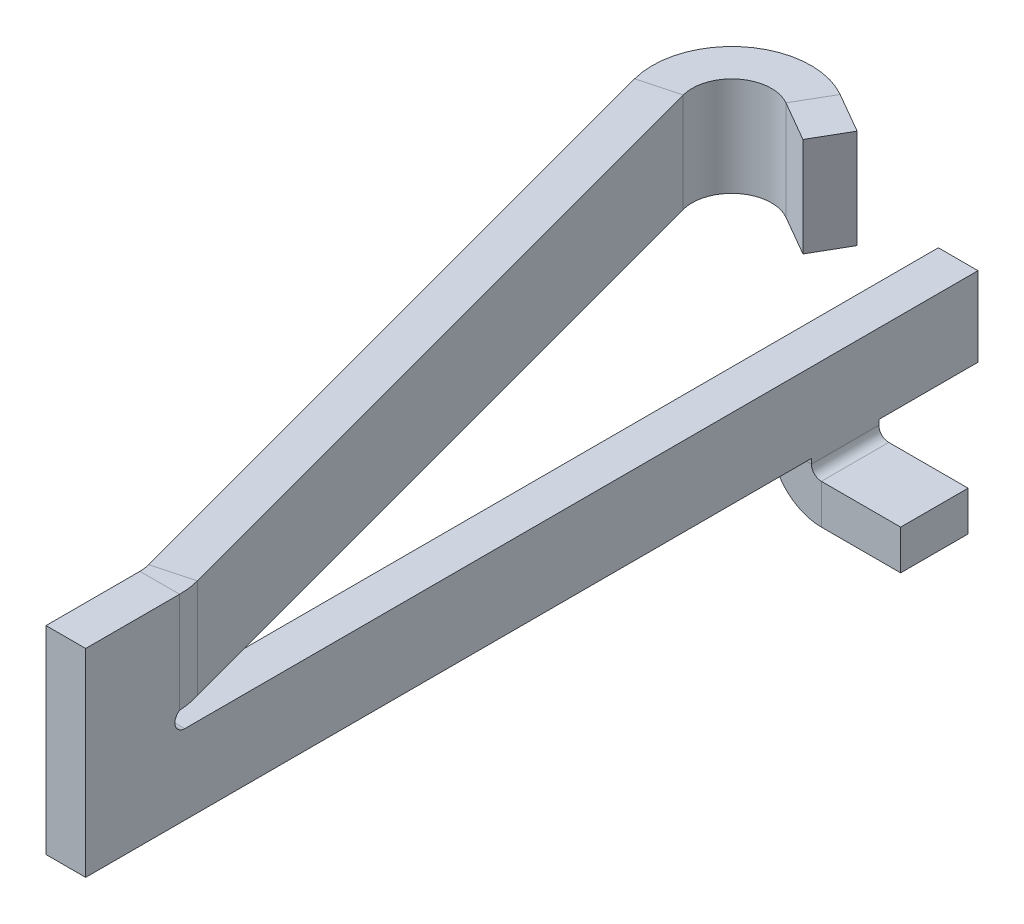
ISO-10303-21;
HEADER;
FILE_DESCRIPTION(('STEP AP214'),'2;1');
FILE_NAME('part.step','',(''),(''),'','','');
FILE_SCHEMA(('AUTOMOTIVE_DESIGN { 1 0 10303 214 1 1 1 1 }'));
ENDSEC;
DATA;
#1=APPLICATION_CONTEXT('core data for automotive mechanical design processes');
#2=APPLICATION_PROTOCOL_DEFINITION('international standard','automotive_design',2000,#1);
#3=PRODUCT_CONTEXT('',#1,'mechanical');
#4=PRODUCT('Part','Part','',(#3));
#5=PRODUCT_RELATED_PRODUCT_CATEGORY('part','',(#4));
#6=PRODUCT_DEFINITION_FORMATION('','',#4);
#7=PRODUCT_DEFINITION_CONTEXT('part definition',#1,'design');
#8=PRODUCT_DEFINITION('design','',#6,#7);
#9=PRODUCT_DEFINITION_SHAPE('','',#8);
#10=(LENGTH_UNIT() NAMED_UNIT(*) SI_UNIT(.MILLI.,.METRE.));
#11=(NAMED_UNIT(*) PLANE_ANGLE_UNIT() SI_UNIT($,.RADIAN.));
#12=(NAMED_UNIT(*) SI_UNIT($,.STERADIAN.) SOLID_ANGLE_UNIT());
#13=UNCERTAINTY_MEASURE_WITH_UNIT(LENGTH_MEASURE(1.E-05),#10,'distance_accuracy_value','');
#14=(GEOMETRIC_REPRESENTATION_CONTEXT(3) GLOBAL_UNCERTAINTY_ASSIGNED_CONTEXT((#13)) GLOBAL_UNIT_ASSIGNED_CONTEXT((#10,
#11,#12)) REPRESENTATION_CONTEXT('',''));
#15=CARTESIAN_POINT('',(0.,0.,0.));
#16=DIRECTION('',(0.,0.,1.));
#17=DIRECTION('',(1.,0.,0.));
#18=AXIS2_PLACEMENT_3D('',#15,#16,#17);
#19=CARTESIAN_POINT('',(4.6,0.662500000000014,-2.65));
#20=DIRECTION('',(1.,0.,0.));
#21=DIRECTION('',(0.,0.,1.));
#22=AXIS2_PLACEMENT_3D('',#19,#20,#21);
#23=PLANE('',#22);
#24=DIRECTION('',(0.,0.,-1.));
#25=VECTOR('',#24,1.);
#26=CARTESIAN_POINT('',(4.6,0.175000000000024,-3.355));
#27=LINE('',#26,#25);
#28=CARTESIAN_POINT('',(4.6,0.175000000000027,-4.06));
#29=VERTEX_POINT('',#28);
#30=CARTESIAN_POINT('',(4.6,0.175000000000028,-4.4));
#31=VERTEX_POINT('',#30);
#32=EDGE_CURVE('E299',#29,#31,#27,.T.);
#33=ORIENTED_EDGE('',*,*,#32,.T.);
#34=DIRECTION('',(0.,1.,0.));
#35=VECTOR('',#34,1.);
#36=CARTESIAN_POINT('',(4.6,0.200000000000026,-4.4));
#37=LINE('',#36,#35);
#38=CARTESIAN_POINT('',(4.6,0.200000000000026,-4.4));
#39=VERTEX_POINT('',#38);
#40=EDGE_CURVE('E367',#31,#39,#37,.T.);
#41=ORIENTED_EDGE('',*,*,#40,.T.);
#42=DIRECTION('',(0.,0.,-1.));
#43=VECTOR('',#42,1.);
#44=CARTESIAN_POINT('',(4.6,0.200000000000028,-4.9));
#45=LINE('',#44,#43);
#46=CARTESIAN_POINT('',(4.6,0.200000000000028,-4.9));
#47=VERTEX_POINT('',#46);
#48=EDGE_CURVE('E11',#39,#47,#45,.T.);
#49=ORIENTED_EDGE('',*,*,#48,.T.);
#50=DIRECTION('',(0.,1.,0.));
#51=VECTOR('',#50,1.);
#52=CARTESIAN_POINT('',(4.6,0.600000000000123,-4.9));
#53=LINE('',#52,#51);
#54=CARTESIAN_POINT('',(4.6,0.600000000000123,-4.9));
#55=VERTEX_POINT('',#54);
#56=EDGE_CURVE('E295',#47,#55,#53,.T.);
#57=ORIENTED_EDGE('',*,*,#56,.T.);
#58=DIRECTION('',(0.,0.,1.));
#59=VECTOR('',#58,1.);
#60=CARTESIAN_POINT('',(4.6,0.6,-0.9));
#61=LINE('',#60,#59);
#62=CARTESIAN_POINT('',(4.6,0.6,-0.9));
#63=VERTEX_POINT('',#62);
#64=EDGE_CURVE('E391',#55,#63,#61,.T.);
#65=ORIENTED_EDGE('',*,*,#64,.T.);
#66=CARTESIAN_POINT('',(4.6,0.65,-0.9));
#67=DIRECTION('',(-1.,0.,0.));
#68=DIRECTION('',(0.,1.,0.));
#69=AXIS2_PLACEMENT_3D('',#66,#67,#68);
#70=CIRCLE('',#69,0.05);
#71=CARTESIAN_POINT('',(4.6,0.692505350194535,-0.873669500482522));
#72=VERTEX_POINT('',#71);
#73=EDGE_CURVE('E293',#63,#72,#70,.T.);
#74=ORIENTED_EDGE('',*,*,#73,.T.);
#75=DIRECTION('',(0.,1.,0.));
#76=VECTOR('',#75,1.);
#77=CARTESIAN_POINT('',(4.6,0.93125,-0.873669500482521));
#78=LINE('',#77,#76);
#79=CARTESIAN_POINT('',(4.6,1.2,-0.873669500482521));
#80=VERTEX_POINT('',#79);
#81=EDGE_CURVE('E372',#72,#80,#78,.T.);
#82=ORIENTED_EDGE('',*,*,#81,.T.);
#83=DIRECTION('',(0.,0.,1.));
#84=VECTOR('',#83,1.);
#85=CARTESIAN_POINT('',(4.6,1.2,-0.4));
#86=LINE('',#85,#84);
#87=CARTESIAN_POINT('',(4.6,1.2,-0.4));
#88=VERTEX_POINT('',#87);
#89=EDGE_CURVE('E218',#80,#88,#86,.T.);
#90=ORIENTED_EDGE('',*,*,#89,.T.);
#91=DIRECTION('',(0.,-1.,0.));
#92=VECTOR('',#91,1.);
#93=CARTESIAN_POINT('',(4.6,0.199999999999844,-0.4));
#94=LINE('',#93,#92);
#95=CARTESIAN_POINT('',(4.6,0.199999999999844,-0.4));
#96=VERTEX_POINT('',#95);
#97=EDGE_CURVE('E378',#88,#96,#94,.T.);
#98=ORIENTED_EDGE('',*,*,#97,.T.);
#99=DIRECTION('',(0.,0.,-1.));
#100=VECTOR('',#99,1.);
#101=CARTESIAN_POINT('',(4.6,0.2,-4.06));
#102=LINE('',#101,#100);
#103=CARTESIAN_POINT('',(4.6,0.2,-4.06));
#104=VERTEX_POINT('',#103);
#105=EDGE_CURVE('E398',#96,#104,#102,.T.);
#106=ORIENTED_EDGE('',*,*,#105,.T.);
#107=DIRECTION('',(0.,-1.,0.));
#108=VECTOR('',#107,1.);
#109=CARTESIAN_POINT('',(4.6,0.125000000000027,-4.06));
#110=LINE('',#109,#108);
#111=EDGE_CURVE('E323',#104,#29,#110,.T.);
#112=ORIENTED_EDGE('',*,*,#111,.T.);
#113=EDGE_LOOP('',(#33,#41,#49,#57,#65,#74,#82,#90,#98,#106,#112));
#114=FACE_BOUND('',#113,.T.);
#115=ADVANCED_FACE('F16',(#114),#23,.T.);
#116=CARTESIAN_POINT('',(4.4,0.200000000000026,-4.4));
#117=DIRECTION('',(0.,-1.,0.));
#118=DIRECTION('',(0.,0.,-1.));
#119=AXIS2_PLACEMENT_3D('',#116,#117,#118);
#120=PLANE('',#119);
#121=DIRECTION('',(0.,0.,1.));
#122=VECTOR('',#121,1.);
#123=CARTESIAN_POINT('',(4.4,0.200000000000028,-4.9));
#124=LINE('',#123,#122);
#125=CARTESIAN_POINT('',(4.4,0.200000000000028,-4.9));
#126=VERTEX_POINT('',#125);
#127=CARTESIAN_POINT('',(4.4,0.200000000000026,-4.4));
#128=VERTEX_POINT('',#127);
#129=EDGE_CURVE('E290',#126,#128,#124,.T.);
#130=ORIENTED_EDGE('',*,*,#129,.F.);
#131=DIRECTION('',(1.,0.,0.));
#132=VECTOR('',#131,1.);
#133=CARTESIAN_POINT('',(4.4,0.200000000000028,-4.9));
#134=LINE('',#133,#132);
#135=EDGE_CURVE('E27',#126,#47,#134,.T.);
#136=ORIENTED_EDGE('',*,*,#135,.T.);
#137=ORIENTED_EDGE('',*,*,#48,.F.);
#138=DIRECTION('',(1.,0.,0.));
#139=VECTOR('',#138,1.);
#140=CARTESIAN_POINT('',(4.4,0.200000000000026,-4.4));
#141=LINE('',#140,#139);
#142=EDGE_CURVE('E335',#128,#39,#141,.T.);
#143=ORIENTED_EDGE('',*,*,#142,.F.);
#144=EDGE_LOOP('',(#130,#136,#137,#143));
#145=FACE_BOUND('',#144,.T.);
#146=ADVANCED_FACE('F780',(#145),#120,.T.);
#147=CARTESIAN_POINT('',(4.4,0.200000000000028,-4.9));
#148=DIRECTION('',(0.,0.,-1.));
#149=DIRECTION('',(-1.,0.,0.));
#150=AXIS2_PLACEMENT_3D('',#147,#148,#149);
#151=PLANE('',#150);
#152=DIRECTION('',(0.,-1.,0.));
#153=VECTOR('',#152,1.);
#154=CARTESIAN_POINT('',(4.4,0.600000000000123,-4.9));
#155=LINE('',#154,#153);
#156=CARTESIAN_POINT('',(4.4,0.600000000000123,-4.9));
#157=VERTEX_POINT('',#156);
#158=EDGE_CURVE('E294',#157,#126,#155,.T.);
#159=ORIENTED_EDGE('',*,*,#158,.F.);
#160=DIRECTION('',(1.,0.,0.));
#161=VECTOR('',#160,1.);
#162=CARTESIAN_POINT('',(4.4,0.600000000000123,-4.9));
#163=LINE('',#162,#161);
#164=EDGE_CURVE('E298',#157,#55,#163,.T.);
#165=ORIENTED_EDGE('',*,*,#164,.T.);
#166=ORIENTED_EDGE('',*,*,#56,.F.);
#167=ORIENTED_EDGE('',*,*,#135,.F.);
#168=EDGE_LOOP('',(#159,#165,#166,#167));
#169=FACE_BOUND('',#168,.T.);
#170=ADVANCED_FACE('F783',(#169),#151,.T.);
#171=CARTESIAN_POINT('',(4.4,0.600000000000123,-4.9));
#172=DIRECTION('',(0.,1.,0.));
#173=DIRECTION('',(0.,0.,-1.));
#174=AXIS2_PLACEMENT_3D('',#171,#172,#173);
#175=PLANE('',#174);
#176=DIRECTION('',(0.,0.,-1.));
#177=VECTOR('',#176,1.);
#178=CARTESIAN_POINT('',(4.4,0.6,-0.9));
#179=LINE('',#178,#177);
#180=CARTESIAN_POINT('',(4.4,0.6,-0.9));
#181=VERTEX_POINT('',#180);
#182=EDGE_CURVE('E508',#181,#157,#179,.T.);
#183=ORIENTED_EDGE('',*,*,#182,.F.);
#184=DIRECTION('',(1.,0.,0.));
#185=VECTOR('',#184,1.);
#186=CARTESIAN_POINT('',(4.4,0.6,-0.9));
#187=LINE('',#186,#185);
#188=EDGE_CURVE('E322',#181,#63,#187,.T.);
#189=ORIENTED_EDGE('',*,*,#188,.T.);
#190=ORIENTED_EDGE('',*,*,#64,.F.);
#191=ORIENTED_EDGE('',*,*,#164,.F.);
#192=EDGE_LOOP('',(#183,#189,#190,#191));
#193=FACE_BOUND('',#192,.T.);
#194=ADVANCED_FACE('F789',(#193),#175,.T.);
#195=CARTESIAN_POINT('',(4.4,1.2,-0.4));
#196=DIRECTION('',(0.,0.,1.));
#197=DIRECTION('',(1.,0.,0.));
#198=AXIS2_PLACEMENT_3D('',#195,#196,#197);
#199=PLANE('',#198);
#200=DIRECTION('',(0.,1.,0.));
#201=VECTOR('',#200,1.);
#202=CARTESIAN_POINT('',(4.4,0.199999999999844,-0.4));
#203=LINE('',#202,#201);
#204=CARTESIAN_POINT('',(4.4,0.199999999999844,-0.4));
#205=VERTEX_POINT('',#204);
#206=CARTESIAN_POINT('',(4.4,1.2,-0.4));
#207=VERTEX_POINT('',#206);
#208=EDGE_CURVE('E386',#205,#207,#203,.T.);
#209=ORIENTED_EDGE('',*,*,#208,.F.);
#210=DIRECTION('',(1.,0.,0.));
#211=VECTOR('',#210,1.);
#212=CARTESIAN_POINT('',(4.4,0.199999999999844,-0.4));
#213=LINE('',#212,#211);
#214=EDGE_CURVE('E388',#205,#96,#213,.T.);
#215=ORIENTED_EDGE('',*,*,#214,.T.);
#216=ORIENTED_EDGE('',*,*,#97,.F.);
#217=DIRECTION('',(1.,0.,0.));
#218=VECTOR('',#217,1.);
#219=CARTESIAN_POINT('',(4.4,1.2,-0.4));
#220=LINE('',#219,#218);
#221=EDGE_CURVE('E311',#207,#88,#220,.T.);
#222=ORIENTED_EDGE('',*,*,#221,.F.);
#223=EDGE_LOOP('',(#209,#215,#216,#222));
#224=FACE_BOUND('',#223,.T.);
#225=ADVANCED_FACE('F385',(#224),#199,.T.);
#226=CARTESIAN_POINT('',(4.4,0.199999999999844,-0.4));
#227=DIRECTION('',(0.,-1.,0.));
#228=DIRECTION('',(0.,0.,-1.));
#229=AXIS2_PLACEMENT_3D('',#226,#227,#228);
#230=PLANE('',#229);
#231=DIRECTION('',(0.,0.,1.));
#232=VECTOR('',#231,1.);
#233=CARTESIAN_POINT('',(4.4,0.2,-4.06));
#234=LINE('',#233,#232);
#235=CARTESIAN_POINT('',(4.4,0.2,-4.06));
#236=VERTEX_POINT('',#235);
#237=EDGE_CURVE('E283',#236,#205,#234,.T.);
#238=ORIENTED_EDGE('',*,*,#237,.F.);
#239=DIRECTION('',(1.,0.,0.));
#240=VECTOR('',#239,1.);
#241=CARTESIAN_POINT('',(4.4,0.2,-4.06));
#242=LINE('',#241,#240);
#243=EDGE_CURVE('E326',#236,#104,#242,.T.);
#244=ORIENTED_EDGE('',*,*,#243,.T.);
#245=ORIENTED_EDGE('',*,*,#105,.F.);
#246=ORIENTED_EDGE('',*,*,#214,.F.);
#247=EDGE_LOOP('',(#238,#244,#245,#246));
#248=FACE_BOUND('',#247,.T.);
#249=ADVANCED_FACE('F549',(#248),#230,.T.);
#250=CARTESIAN_POINT('',(4.4,0.2,-4.06));
#251=DIRECTION('',(0.,0.,1.));
#252=DIRECTION('',(1.,0.,0.));
#253=AXIS2_PLACEMENT_3D('',#250,#251,#252);
#254=PLANE('',#253);
#255=DIRECTION('',(1.,0.,0.));
#256=VECTOR('',#255,1.);
#257=CARTESIAN_POINT('',(4.5,0.175000000000027,-4.06));
#258=LINE('',#257,#256);
#259=CARTESIAN_POINT('',(4.4,0.175000000000027,-4.06));
#260=VERTEX_POINT('',#259);
#261=EDGE_CURVE('E314',#260,#29,#258,.T.);
#262=ORIENTED_EDGE('',*,*,#261,.T.);
#263=ORIENTED_EDGE('',*,*,#111,.F.);
#264=ORIENTED_EDGE('',*,*,#243,.F.);
#265=DIRECTION('',(0.,1.,0.));
#266=VECTOR('',#265,1.);
#267=CARTESIAN_POINT('',(4.4,0.125000000000027,-4.06));
#268=LINE('',#267,#266);
#269=EDGE_CURVE('E279',#260,#236,#268,.T.);
#270=ORIENTED_EDGE('',*,*,#269,.F.);
#271=EDGE_LOOP('',(#262,#263,#264,#270));
#272=FACE_BOUND('',#271,.T.);
#273=ADVANCED_FACE('F551',(#272),#254,.T.);
#274=CARTESIAN_POINT('',(4.4,0.65,-0.9));
#275=DIRECTION('',(1.,0.,0.));
#276=DIRECTION('',(0.,1.,0.));
#277=AXIS2_PLACEMENT_3D('',#274,#275,#276);
#278=CYLINDRICAL_SURFACE('',#277,0.05);
#279=DIRECTION('',(1.,0.,0.));
#280=VECTOR('',#279,1.);
#281=CARTESIAN_POINT('',(4.4,0.692505350194535,-0.873669500482522));
#282=LINE('',#281,#280);
#283=CARTESIAN_POINT('',(4.4,0.692505350194535,-0.873669500482522));
#284=VERTEX_POINT('',#283);
#285=EDGE_CURVE('E232',#284,#72,#282,.T.);
#286=ORIENTED_EDGE('',*,*,#285,.T.);
#287=ORIENTED_EDGE('',*,*,#73,.F.);
#288=ORIENTED_EDGE('',*,*,#188,.F.);
#289=CARTESIAN_POINT('',(4.4,0.65,-0.9));
#290=DIRECTION('',(1.,0.,0.));
#291=DIRECTION('',(0.,1.,0.));
#292=AXIS2_PLACEMENT_3D('',#289,#290,#291);
#293=CIRCLE('',#292,0.05);
#294=EDGE_CURVE('E168',#284,#181,#293,.T.);
#295=ORIENTED_EDGE('',*,*,#294,.F.);
#296=EDGE_LOOP('',(#286,#287,#288,#295));
#297=FACE_BOUND('',#296,.T.);
#298=ADVANCED_FACE('F790',(#297),#278,.F.);
#299=CARTESIAN_POINT('',(4.4,0.662500000000014,-2.65));
#300=DIRECTION('',(1.,0.,0.));
#301=DIRECTION('',(0.,0.,1.));
#302=AXIS2_PLACEMENT_3D('',#299,#300,#301);
#303=PLANE('',#302);
#304=DIRECTION('',(0.,0.,1.));
#305=VECTOR('',#304,1.);
#306=CARTESIAN_POINT('',(4.4,0.175000000000024,-3.355));
#307=LINE('',#306,#305);
#308=CARTESIAN_POINT('',(4.4,0.175000000000028,-4.4));
#309=VERTEX_POINT('',#308);
#310=EDGE_CURVE('E327',#309,#260,#307,.T.);
#311=ORIENTED_EDGE('',*,*,#310,.T.);
#312=ORIENTED_EDGE('',*,*,#269,.T.);
#313=ORIENTED_EDGE('',*,*,#237,.T.);
#314=ORIENTED_EDGE('',*,*,#208,.T.);
#315=DIRECTION('',(0.,0.,-1.));
#316=VECTOR('',#315,1.);
#317=CARTESIAN_POINT('',(4.4,1.2,-0.4));
#318=LINE('',#317,#316);
#319=CARTESIAN_POINT('',(4.4,1.2,-0.873669500482521));
#320=VERTEX_POINT('',#319);
#321=EDGE_CURVE('E157',#207,#320,#318,.T.);
#322=ORIENTED_EDGE('',*,*,#321,.T.);
#323=DIRECTION('',(0.,-1.,0.));
#324=VECTOR('',#323,1.);
#325=CARTESIAN_POINT('',(4.4,0.93125,-0.873669500482521));
#326=LINE('',#325,#324);
#327=EDGE_CURVE('E287',#320,#284,#326,.T.);
#328=ORIENTED_EDGE('',*,*,#327,.T.);
#329=ORIENTED_EDGE('',*,*,#294,.T.);
#330=ORIENTED_EDGE('',*,*,#182,.T.);
#331=ORIENTED_EDGE('',*,*,#158,.T.);
#332=ORIENTED_EDGE('',*,*,#129,.T.);
#333=DIRECTION('',(0.,-1.,0.));
#334=VECTOR('',#333,1.);
#335=CARTESIAN_POINT('',(4.4,0.200000000000026,-4.4));
#336=LINE('',#335,#334);
#337=EDGE_CURVE('E303',#128,#309,#336,.T.);
#338=ORIENTED_EDGE('',*,*,#337,.T.);
#339=EDGE_LOOP('',(#311,#312,#313,#314,#322,#328,#329,#330,#331,#332,#338));
#340=FACE_BOUND('',#339,.T.);
#341=ADVANCED_FACE('F778',(#340),#303,.F.);
#342=CARTESIAN_POINT('',(4.4,1.2,-0.9));
#343=DIRECTION('',(0.,1.,0.));
#344=DIRECTION('',(1.,0.,0.));
#345=AXIS2_PLACEMENT_3D('',#342,#343,#344);
#346=PLANE('',#345);
#347=DIRECTION('',(-1.,0.,0.));
#348=VECTOR('',#347,1.);
#349=CARTESIAN_POINT('',(4.4,1.2,-0.873669500482521));
#350=LINE('',#349,#348);
#351=EDGE_CURVE('E248',#80,#320,#350,.T.);
#352=ORIENTED_EDGE('',*,*,#351,.T.);
#353=ORIENTED_EDGE('',*,*,#321,.F.);
#354=ORIENTED_EDGE('',*,*,#221,.T.);
#355=ORIENTED_EDGE('',*,*,#89,.F.);
#356=EDGE_LOOP('',(#352,#353,#354,#355));
#357=FACE_BOUND('',#356,.T.);
#358=ADVANCED_FACE('F382',(#357),#346,.T.);
#359=CARTESIAN_POINT('',(4.2,0.946252675097268,-0.873669500482522));
#360=DIRECTION('',(0.,1.,0.));
#361=DIRECTION('',(1.,0.,0.));
#362=AXIS2_PLACEMENT_3D('',#359,#360,#361);
#363=CYLINDRICAL_SURFACE('',#362,0.2);
#364=DIRECTION('',(0.,1.,0.));
#365=VECTOR('',#364,1.);
#366=CARTESIAN_POINT('',(4.39318516525782,0.948001253419913,-0.925433309503026));
#367=LINE('',#366,#365);
#368=CARTESIAN_POINT('',(4.39318516525781,0.7,-0.925433309503025));
#369=VERTEX_POINT('',#368);
#370=CARTESIAN_POINT('',(4.39318516525781,1.2,-0.925433309503025));
#371=VERTEX_POINT('',#370);
#372=EDGE_CURVE('E251',#369,#371,#367,.T.);
#373=ORIENTED_EDGE('',*,*,#372,.F.);
#374=CARTESIAN_POINT('',(4.4,0.692505350194535,-0.873669500482522));
#375=CARTESIAN_POINT('',(4.4,0.695003566796357,-0.891122793002465));
#376=CARTESIAN_POINT('',(4.39770240976172,0.697501783398179,-0.908574723504235));
#377=CARTESIAN_POINT('',(4.39318516525781,0.7,-0.925433309503025));
#378=(BOUNDED_CURVE() B_SPLINE_CURVE(3,(#374,#375,#376,#377),.UNSPECIFIED.,.F.,
.F.) B_SPLINE_CURVE_WITH_KNOTS((4,4),(0.,0.261799387799145),
.UNSPECIFIED.) CURVE() GEOMETRIC_REPRESENTATION_ITEM() RATIONAL_B_SPLINE_CURVE((1.,1.,1.,1.)) REPRESENTATION_ITEM(''));
#379=EDGE_CURVE('E226',#284,#369,#378,.T.);
#380=ORIENTED_EDGE('',*,*,#379,.F.);
#381=ORIENTED_EDGE('',*,*,#327,.F.);
#382=CARTESIAN_POINT('',(4.2,1.2,-0.873669500482522));
#383=DIRECTION('',(0.,-1.,0.));
#384=DIRECTION('',(0.965925826289069,0.,-0.258819045102517));
#385=AXIS2_PLACEMENT_3D('',#382,#383,#384);
#386=CIRCLE('',#385,0.2);
#387=EDGE_CURVE('E254',#371,#320,#386,.T.);
#388=ORIENTED_EDGE('',*,*,#387,.F.);
#389=EDGE_LOOP('',(#373,#380,#381,#388));
#390=FACE_BOUND('',#389,.T.);
#391=ADVANCED_FACE('F252',(#390),#363,.F.);
#392=CARTESIAN_POINT('',(4.4,0.692505350194535,-0.873669500482521));
#393=CARTESIAN_POINT('',(4.46666666666667,0.692505350194535,-0.873669500482521));
#394=CARTESIAN_POINT('',(4.53333333333333,0.692505350194535,-0.873669500482521));
#395=CARTESIAN_POINT('',(4.6,0.692505350194535,-0.873669500482521));
#396=CARTESIAN_POINT('',(4.4,0.695003566796357,-0.891122793002464));
#397=CARTESIAN_POINT('',(4.46666759340885,0.695003566796357,-0.896940659755358));
#398=CARTESIAN_POINT('',(4.53333240659115,0.695003566796357,-0.902758218769514));
#399=CARTESIAN_POINT('',(4.6,0.695003566796357,-0.908576085522408));
#400=CARTESIAN_POINT('',(4.39770240976172,0.697501783398179,-0.908574723504234));
#401=CARTESIAN_POINT('',(4.46360413472939,0.697501783398179,-0.920209938619068));
#402=CARTESIAN_POINT('',(4.52950309455577,0.697501783398179,-0.931844731411114));
#403=CARTESIAN_POINT('',(4.59540481952344,0.697501783398179,-0.943479946525949));
#404=CARTESIAN_POINT('',(4.39318516525781,0.7,-0.925433309503025));
#405=CARTESIAN_POINT('',(4.45758022034375,0.7,-0.94268791250986));
#406=CARTESIAN_POINT('',(4.52197527542969,0.7,-0.959942515516695));
#407=CARTESIAN_POINT('',(4.58637033051563,0.7,-0.977197118523531));
#408=(BOUNDED_SURFACE() B_SPLINE_SURFACE(3,3,((#392,#393,#394,#395),(#396,#397,#398,#399),(#400,
#401,#402,#403),(#404,#405,#406,#407)),.UNSPECIFIED.,.F.,.F.,
.F.) B_SPLINE_SURFACE_WITH_KNOTS((4,4),(4,4),(0.,0.00684791992554108),(0.,0.02),
.UNSPECIFIED.) GEOMETRIC_REPRESENTATION_ITEM() RATIONAL_B_SPLINE_SURFACE(((1.,1.,1.,1.),(1.,1.,
1.,1.),(1.,1.,1.,1.),(1.,1.,1.,1.))) REPRESENTATION_ITEM('') SURFACE());
#409=DIRECTION('',(0.965925826289069,0.,-0.258819045102517));
#410=VECTOR('',#409,1.);
#411=CARTESIAN_POINT('',(4.39318516525781,0.7,-0.925433309503025));
#412=LINE('',#411,#410);
#413=CARTESIAN_POINT('',(4.58637033051563,0.7,-0.977197118523529));
#414=VERTEX_POINT('',#413);
#415=EDGE_CURVE('E230',#369,#414,#412,.T.);
#416=CARTESIAN_POINT('',(4.6,0.692505350194535,-0.873669500482521));
#417=CARTESIAN_POINT('',(4.6,0.695003566796357,-0.908576085522407));
#418=CARTESIAN_POINT('',(4.59540481952344,0.697501783398179,-0.943479946525947));
#419=CARTESIAN_POINT('',(4.58637033051563,0.7,-0.977197118523528));
#420=(BOUNDED_CURVE() B_SPLINE_CURVE(3,(#416,#417,#418,#419),.UNSPECIFIED.,.F.,
.F.) B_SPLINE_CURVE_WITH_KNOTS((4,4),(0.,0.261799387799145),
.UNSPECIFIED.) CURVE() GEOMETRIC_REPRESENTATION_ITEM() RATIONAL_B_SPLINE_CURVE((1.,1.,1.,1.)) REPRESENTATION_ITEM(''));
#421=EDGE_CURVE('E286',#72,#414,#420,.T.);
#422=ORIENTED_EDGE('',*,*,#379,.T.);
#423=ORIENTED_EDGE('',*,*,#415,.T.);
#424=ORIENTED_EDGE('',*,*,#421,.F.);
#425=ORIENTED_EDGE('',*,*,#285,.F.);
#426=EDGE_LOOP('',(#422,#423,#424,#425));
#427=FACE_BOUND('',#426,.T.);
#428=ADVANCED_FACE('F228',(#427),#408,.T.);
#429=CARTESIAN_POINT('',(4.39318516525782,0.7,-0.925433309503025));
#430=DIRECTION('',(0.,-1.,0.));
#431=DIRECTION('',(0.,0.,-1.));
#432=AXIS2_PLACEMENT_3D('',#429,#430,#431);
#433=PLANE('',#432);
#434=DIRECTION('',(0.965925826289069,0.,-0.258819045102518));
#435=VECTOR('',#434,1.);
#436=CARTESIAN_POINT('',(3.59310012673842,0.7,-4.2977616541488));
#437=LINE('',#436,#435);
#438=CARTESIAN_POINT('',(3.49650754410951,0.7,-4.27187974963855));
#439=VERTEX_POINT('',#438);
#440=CARTESIAN_POINT('',(3.68969270936732,0.7,-4.32364355865905));
#441=VERTEX_POINT('',#440);
#442=EDGE_CURVE('E360',#439,#441,#437,.T.);
#443=ORIENTED_EDGE('',*,*,#442,.T.);
#444=DIRECTION('',(-0.258819045102517,0.,-0.965925826289069));
#445=VECTOR('',#444,1.);
#446=CARTESIAN_POINT('',(4.58637033051563,0.7,-0.977197118523529));
#447=LINE('',#446,#445);
#448=EDGE_CURVE('E245',#414,#441,#447,.T.);
#449=ORIENTED_EDGE('',*,*,#448,.F.);
#450=ORIENTED_EDGE('',*,*,#415,.F.);
#451=DIRECTION('',(-0.258819045102517,0.,-0.965925826289069));
#452=VECTOR('',#451,1.);
#453=CARTESIAN_POINT('',(4.39318516525782,0.7,-0.925433309503025));
#454=LINE('',#453,#452);
#455=EDGE_CURVE('E243',#369,#439,#454,.T.);
#456=ORIENTED_EDGE('',*,*,#455,.T.);
#457=EDGE_LOOP('',(#443,#449,#450,#456));
#458=FACE_BOUND('',#457,.T.);
#459=ADVANCED_FACE('F241',(#458),#433,.T.);
#460=CARTESIAN_POINT('',(4.39318516525781,1.2,-0.925433309503025));
#461=DIRECTION('',(0.,1.,0.));
#462=DIRECTION('',(0.,0.,-1.));
#463=AXIS2_PLACEMENT_3D('',#460,#461,#462);
#464=PLANE('',#463);
#465=DIRECTION('',(0.965925826289069,0.,-0.258819045102517));
#466=VECTOR('',#465,1.);
#467=CARTESIAN_POINT('',(4.42216294004649,1.2,-0.933197880856101));
#468=LINE('',#467,#466);
#469=CARTESIAN_POINT('',(4.58637033051563,1.2,-0.977197118523529));
#470=VERTEX_POINT('',#469);
#471=EDGE_CURVE('E266',#371,#470,#468,.T.);
#472=ORIENTED_EDGE('',*,*,#471,.F.);
#473=ORIENTED_EDGE('',*,*,#387,.T.);
#474=ORIENTED_EDGE('',*,*,#351,.F.);
#475=CARTESIAN_POINT('',(4.2,1.2,-0.873669500482522));
#476=DIRECTION('',(0.,-1.,0.));
#477=DIRECTION('',(0.965925826289069,0.,-0.258819045102517));
#478=AXIS2_PLACEMENT_3D('',#475,#476,#477);
#479=CIRCLE('',#478,0.4);
#480=EDGE_CURVE('E258',#470,#80,#479,.T.);
#481=ORIENTED_EDGE('',*,*,#480,.F.);
#482=EDGE_LOOP('',(#472,#473,#474,#481));
#483=FACE_BOUND('',#482,.T.);
#484=ADVANCED_FACE('F794',(#483),#464,.T.);
#485=CARTESIAN_POINT('',(4.2,0.946252675097268,-0.873669500482522));
#486=DIRECTION('',(0.,1.,0.));
#487=DIRECTION('',(1.,0.,0.));
#488=AXIS2_PLACEMENT_3D('',#485,#486,#487);
#489=CYLINDRICAL_SURFACE('',#488,0.4);
#490=DIRECTION('',(0.,-1.,0.));
#491=VECTOR('',#490,1.);
#492=CARTESIAN_POINT('',(4.58637033051563,0.948001253419913,-0.977197118523529));
#493=LINE('',#492,#491);
#494=EDGE_CURVE('E336',#470,#414,#493,.T.);
#495=ORIENTED_EDGE('',*,*,#494,.F.);
#496=ORIENTED_EDGE('',*,*,#480,.T.);
#497=ORIENTED_EDGE('',*,*,#81,.F.);
#498=ORIENTED_EDGE('',*,*,#421,.T.);
#499=EDGE_LOOP('',(#495,#496,#497,#498));
#500=FACE_BOUND('',#499,.T.);
#501=ADVANCED_FACE('F792',(#500),#489,.T.);
#502=CARTESIAN_POINT('',(3.89162464850674,0.949749831742559,-2.79728264108856));
#503=DIRECTION('',(0.965925826289069,0.,-0.258819045102519));
#504=DIRECTION('',(0.,-1.,0.));
#505=AXIS2_PLACEMENT_3D('',#502,#503,#504);
#506=PLANE('',#505);
#507=DIRECTION('',(0.,-1.,0.));
#508=VECTOR('',#507,1.);
#509=CARTESIAN_POINT('',(3.49650754410951,0.82487491587128,-4.27187974963855));
#510=LINE('',#509,#508);
#511=CARTESIAN_POINT('',(3.49650754410951,1.2,-4.27187974963855));
#512=VERTEX_POINT('',#511);
#513=EDGE_CURVE('E263',#512,#439,#510,.T.);
#514=ORIENTED_EDGE('',*,*,#513,.T.);
#515=ORIENTED_EDGE('',*,*,#455,.F.);
#516=ORIENTED_EDGE('',*,*,#372,.T.);
#517=DIRECTION('',(0.258819045102516,0.,0.96592582628907));
#518=VECTOR('',#517,1.);
#519=CARTESIAN_POINT('',(4.60459220804064,1.2,-0.136451484759603));
#520=LINE('',#519,#518);
#521=EDGE_CURVE('E273',#512,#371,#520,.T.);
#522=ORIENTED_EDGE('',*,*,#521,.F.);
#523=EDGE_LOOP('',(#514,#515,#516,#522));
#524=FACE_BOUND('',#523,.T.);
#525=ADVANCED_FACE('F261',(#524),#506,.F.);
#526=CARTESIAN_POINT('',(3.37153865433212,1.2,-4.73826999565325));
#527=DIRECTION('',(0.,1.,0.));
#528=DIRECTION('',(0.,0.,-1.));
#529=AXIS2_PLACEMENT_3D('',#526,#527,#528);
#530=PLANE('',#529);
#531=DIRECTION('',(-0.965925826289069,0.,0.258819045102518));
#532=VECTOR('',#531,1.);
#533=CARTESIAN_POINT('',(3.59310012673842,1.2,-4.2977616541488));
#534=LINE('',#533,#532);
#535=CARTESIAN_POINT('',(3.68969270936733,1.2,-4.32364355865905));
#536=VERTEX_POINT('',#535);
#537=EDGE_CURVE('E20',#536,#512,#534,.T.);
#538=ORIENTED_EDGE('',*,*,#537,.T.);
#539=ORIENTED_EDGE('',*,*,#521,.T.);
#540=ORIENTED_EDGE('',*,*,#471,.T.);
#541=DIRECTION('',(0.258819045102517,0.,0.965925826289069));
#542=VECTOR('',#541,1.);
#543=CARTESIAN_POINT('',(4.58637033051563,1.2,-0.977197118523529));
#544=LINE('',#543,#542);
#545=EDGE_CURVE('E339',#536,#470,#544,.T.);
#546=ORIENTED_EDGE('',*,*,#545,.F.);
#547=EDGE_LOOP('',(#538,#539,#540,#546));
#548=FACE_BOUND('',#547,.T.);
#549=ADVANCED_FACE('F797',(#548),#530,.T.);
#550=CARTESIAN_POINT('',(4.08480981376456,0.949749831742559,-2.84904645010907));
#551=DIRECTION('',(0.965925826289069,0.,-0.258819045102517));
#552=DIRECTION('',(0.,-1.,0.));
#553=AXIS2_PLACEMENT_3D('',#550,#551,#552);
#554=PLANE('',#553);
#555=DIRECTION('',(0.,1.,0.));
#556=VECTOR('',#555,1.);
#557=CARTESIAN_POINT('',(3.68969270936733,0.82487491587128,-4.32364355865905));
#558=LINE('',#557,#556);
#559=EDGE_CURVE('E343',#441,#536,#558,.T.);
#560=ORIENTED_EDGE('',*,*,#559,.T.);
#561=ORIENTED_EDGE('',*,*,#545,.T.);
#562=ORIENTED_EDGE('',*,*,#494,.T.);
#563=ORIENTED_EDGE('',*,*,#448,.T.);
#564=EDGE_LOOP('',(#560,#561,#562,#563));
#565=FACE_BOUND('',#564,.T.);
#566=ADVANCED_FACE('F724',(#565),#554,.T.);
#567=CARTESIAN_POINT('',(3.91907090484135,0.95,-4.81639152729315));
#568=DIRECTION('',(0.500000000000008,0.,-0.866025403784434));
#569=DIRECTION('',(0.,-1.,0.));
#570=AXIS2_PLACEMENT_3D('',#567,#568,#569);
#571=PLANE('',#570);
#572=DIRECTION('',(0.,1.,0.));
#573=VECTOR('',#572,1.);
#574=CARTESIAN_POINT('',(4.08287787462514,0.95,-4.72181752919333));
#575=LINE('',#574,#573);
#576=CARTESIAN_POINT('',(4.08287787462514,0.7,-4.72181752919333));
#577=VERTEX_POINT('',#576);
#578=CARTESIAN_POINT('',(4.08287787462514,1.2,-4.72181752919333));
#579=VERTEX_POINT('',#578);
#580=EDGE_CURVE('E362',#577,#579,#575,.T.);
#581=ORIENTED_EDGE('',*,*,#580,.T.);
#582=DIRECTION('',(0.866025403784435,0.,0.500000000000007));
#583=VECTOR('',#582,1.);
#584=CARTESIAN_POINT('',(3.3754961225738,1.2,-5.13022457416001));
#585=LINE('',#584,#583);
#586=CARTESIAN_POINT('',(4.28580024909606,1.2,-4.60466024166795));
#587=VERTEX_POINT('',#586);
#588=EDGE_CURVE('E305',#579,#587,#585,.T.);
#589=ORIENTED_EDGE('',*,*,#588,.T.);
#590=DIRECTION('',(0.,-1.,0.));
#591=VECTOR('',#590,1.);
#592=CARTESIAN_POINT('',(4.28580024909606,0.7,-4.60466024166795));
#593=LINE('',#592,#591);
#594=CARTESIAN_POINT('',(4.28580024909606,0.7,-4.60466024166795));
#595=VERTEX_POINT('',#594);
#596=EDGE_CURVE('E277',#587,#595,#593,.T.);
#597=ORIENTED_EDGE('',*,*,#596,.T.);
#598=DIRECTION('',(-0.866025403784435,0.,-0.500000000000007));
#599=VECTOR('',#598,1.);
#600=CARTESIAN_POINT('',(4.08287787462514,0.7,-4.72181752919333));
#601=LINE('',#600,#599);
#602=EDGE_CURVE('E410',#595,#577,#601,.T.);
#603=ORIENTED_EDGE('',*,*,#602,.T.);
#604=EDGE_LOOP('',(#581,#589,#597,#603));
#605=FACE_BOUND('',#604,.T.);
#606=ADVANCED_FACE('F753',(#605),#571,.T.);
#607=CARTESIAN_POINT('',(3.88287787462514,0.95,-4.37540736767956));
#608=DIRECTION('',(0.,-1.,0.));
#609=DIRECTION('',(-0.965925826289069,0.,0.258819045102517));
#610=AXIS2_PLACEMENT_3D('',#607,#608,#609);
#611=CYLINDRICAL_SURFACE('',#610,0.2);
#612=DIRECTION('',(0.,-1.,0.));
#613=VECTOR('',#612,1.);
#614=CARTESIAN_POINT('',(3.98287787462514,0.95,-4.54861244843644));
#615=LINE('',#614,#613);
#616=CARTESIAN_POINT('',(3.98287787462514,1.2,-4.54861244843644));
#617=VERTEX_POINT('',#616);
#618=CARTESIAN_POINT('',(3.98287787462514,0.7,-4.54861244843645));
#619=VERTEX_POINT('',#618);
#620=EDGE_CURVE('E309',#617,#619,#615,.T.);
#621=ORIENTED_EDGE('',*,*,#620,.F.);
#622=CARTESIAN_POINT('',(3.88287787462514,1.2,-4.37540736767956));
#623=DIRECTION('',(0.,1.,0.));
#624=DIRECTION('',(0.500000000000008,0.,-0.866025403784434));
#625=AXIS2_PLACEMENT_3D('',#622,#623,#624);
#626=CIRCLE('',#625,0.2);
#627=EDGE_CURVE('E414',#617,#536,#626,.T.);
#628=ORIENTED_EDGE('',*,*,#627,.T.);
#629=ORIENTED_EDGE('',*,*,#559,.F.);
#630=CARTESIAN_POINT('',(3.88287787462514,0.7,-4.37540736767956));
#631=DIRECTION('',(0.,1.,0.));
#632=DIRECTION('',(0.500000000000006,0.,-0.866025403784435));
#633=AXIS2_PLACEMENT_3D('',#630,#631,#632);
#634=CIRCLE('',#633,0.2);
#635=EDGE_CURVE('E356',#619,#441,#634,.T.);
#636=ORIENTED_EDGE('',*,*,#635,.F.);
#637=EDGE_LOOP('',(#621,#628,#629,#636));
#638=FACE_BOUND('',#637,.T.);
#639=ADVANCED_FACE('F728',(#638),#611,.F.);
#640=CARTESIAN_POINT('',(4.18580024909605,1.2,-4.43145516091106));
#641=DIRECTION('',(0.866025403784434,0.,0.500000000000008));
#642=DIRECTION('',(0.,-1.,0.));
#643=AXIS2_PLACEMENT_3D('',#640,#641,#642);
#644=PLANE('',#643);
#645=DIRECTION('',(0.,1.,0.));
#646=VECTOR('',#645,1.);
#647=CARTESIAN_POINT('',(4.18580024909605,0.7,-4.43145516091106));
#648=LINE('',#647,#646);
#649=CARTESIAN_POINT('',(4.18580024909605,0.7,-4.43145516091106));
#650=VERTEX_POINT('',#649);
#651=CARTESIAN_POINT('',(4.18580024909605,1.2,-4.43145516091106));
#652=VERTEX_POINT('',#651);
#653=EDGE_CURVE('E438',#650,#652,#648,.T.);
#654=ORIENTED_EDGE('',*,*,#653,.F.);
#655=DIRECTION('',(0.500000000000008,0.,-0.866025403784434));
#656=VECTOR('',#655,1.);
#657=CARTESIAN_POINT('',(4.18580024909605,0.7,-4.43145516091106));
#658=LINE('',#657,#656);
#659=EDGE_CURVE('E413',#650,#595,#658,.T.);
#660=ORIENTED_EDGE('',*,*,#659,.T.);
#661=ORIENTED_EDGE('',*,*,#596,.F.);
#662=DIRECTION('',(0.500000000000008,0.,-0.866025403784434));
#663=VECTOR('',#662,1.);
#664=CARTESIAN_POINT('',(4.18580024909605,1.2,-4.43145516091106));
#665=LINE('',#664,#663);
#666=EDGE_CURVE('E310',#652,#587,#665,.T.);
#667=ORIENTED_EDGE('',*,*,#666,.F.);
#668=EDGE_LOOP('',(#654,#660,#661,#667));
#669=FACE_BOUND('',#668,.T.);
#670=ADVANCED_FACE('F757',(#669),#644,.T.);
#671=CARTESIAN_POINT('',(4.18580024909605,0.7,-4.43145516091106));
#672=DIRECTION('',(0.,-1.,0.));
#673=DIRECTION('',(-1.,0.,0.));
#674=AXIS2_PLACEMENT_3D('',#671,#672,#673);
#675=PLANE('',#674);
#676=DIRECTION('',(0.500000000000007,0.,-0.866025403784435));
#677=VECTOR('',#676,1.);
#678=CARTESIAN_POINT('',(3.99787787462514,0.7,-4.57459321054998));
#679=LINE('',#678,#677);
#680=EDGE_CURVE('E361',#619,#577,#679,.T.);
#681=ORIENTED_EDGE('',*,*,#680,.T.);
#682=ORIENTED_EDGE('',*,*,#602,.F.);
#683=ORIENTED_EDGE('',*,*,#659,.F.);
#684=DIRECTION('',(-0.866025403784435,0.,-0.500000000000007));
#685=VECTOR('',#684,1.);
#686=CARTESIAN_POINT('',(3.2754961225738,0.7,-4.95701949340312));
#687=LINE('',#686,#685);
#688=EDGE_CURVE('E441',#650,#619,#687,.T.);
#689=ORIENTED_EDGE('',*,*,#688,.T.);
#690=EDGE_LOOP('',(#681,#682,#683,#689));
#691=FACE_BOUND('',#690,.T.);
#692=ADVANCED_FACE('F738',(#691),#675,.T.);
#693=CARTESIAN_POINT('',(4.08287787462514,1.2,-4.72181752919333));
#694=DIRECTION('',(0.,1.,0.));
#695=DIRECTION('',(0.,0.,-1.));
#696=AXIS2_PLACEMENT_3D('',#693,#694,#695);
#697=PLANE('',#696);
#698=DIRECTION('',(-0.500000000000007,0.,0.866025403784435));
#699=VECTOR('',#698,1.);
#700=CARTESIAN_POINT('',(3.99787787462514,1.2,-4.57459321054998));
#701=LINE('',#700,#699);
#702=EDGE_CURVE('E347',#579,#617,#701,.T.);
#703=ORIENTED_EDGE('',*,*,#702,.F.);
#704=CARTESIAN_POINT('',(3.88287787462514,1.2,-4.37540736767956));
#705=DIRECTION('',(0.,-1.,0.));
#706=DIRECTION('',(-0.96592582628907,0.,0.258819045102515));
#707=AXIS2_PLACEMENT_3D('',#704,#705,#706);
#708=CIRCLE('',#707,0.4);
#709=EDGE_CURVE('E409',#512,#579,#708,.T.);
#710=ORIENTED_EDGE('',*,*,#709,.F.);
#711=ORIENTED_EDGE('',*,*,#537,.F.);
#712=ORIENTED_EDGE('',*,*,#627,.F.);
#713=EDGE_LOOP('',(#703,#710,#711,#712));
#714=FACE_BOUND('',#713,.T.);
#715=ADVANCED_FACE('F749',(#714),#697,.T.);
#716=CARTESIAN_POINT('',(3.98287787462514,0.7,-4.54861244843644));
#717=DIRECTION('',(0.,-1.,0.));
#718=DIRECTION('',(-1.,0.,0.));
#719=AXIS2_PLACEMENT_3D('',#716,#717,#718);
#720=PLANE('',#719);
#721=ORIENTED_EDGE('',*,*,#680,.F.);
#722=ORIENTED_EDGE('',*,*,#635,.T.);
#723=ORIENTED_EDGE('',*,*,#442,.F.);
#724=CARTESIAN_POINT('',(3.88287787462514,0.7,-4.37540736767956));
#725=DIRECTION('',(0.,1.,0.));
#726=DIRECTION('',(0.5,0.,-0.866025403784436));
#727=AXIS2_PLACEMENT_3D('',#724,#725,#726);
#728=CIRCLE('',#727,0.4);
#729=EDGE_CURVE('E366',#577,#439,#728,.T.);
#730=ORIENTED_EDGE('',*,*,#729,.F.);
#731=EDGE_LOOP('',(#721,#722,#723,#730));
#732=FACE_BOUND('',#731,.T.);
#733=ADVANCED_FACE('F733',(#732),#720,.T.);
#734=CARTESIAN_POINT('',(3.81907090484134,0.95,-4.64318644653626));
#735=DIRECTION('',(-0.500000000000007,0.,0.866025403784435));
#736=DIRECTION('',(0.,1.,0.));
#737=AXIS2_PLACEMENT_3D('',#734,#735,#736);
#738=PLANE('',#737);
#739=ORIENTED_EDGE('',*,*,#620,.T.);
#740=ORIENTED_EDGE('',*,*,#688,.F.);
#741=ORIENTED_EDGE('',*,*,#653,.T.);
#742=DIRECTION('',(-0.866025403784435,0.,-0.500000000000007));
#743=VECTOR('',#742,1.);
#744=CARTESIAN_POINT('',(3.2754961225738,1.2,-4.95701949340312));
#745=LINE('',#744,#743);
#746=EDGE_CURVE('E344',#652,#617,#745,.T.);
#747=ORIENTED_EDGE('',*,*,#746,.T.);
#748=EDGE_LOOP('',(#739,#740,#741,#747));
#749=FACE_BOUND('',#748,.T.);
#750=ADVANCED_FACE('F741',(#749),#738,.T.);
#751=CARTESIAN_POINT('',(3.45234156058663,1.2,-4.85491773216145));
#752=DIRECTION('',(0.,1.,0.));
#753=DIRECTION('',(0.,0.,-1.));
#754=AXIS2_PLACEMENT_3D('',#751,#752,#753);
#755=PLANE('',#754);
#756=ORIENTED_EDGE('',*,*,#702,.T.);
#757=ORIENTED_EDGE('',*,*,#746,.F.);
#758=ORIENTED_EDGE('',*,*,#666,.T.);
#759=ORIENTED_EDGE('',*,*,#588,.F.);
#760=EDGE_LOOP('',(#756,#757,#758,#759));
#761=FACE_BOUND('',#760,.T.);
#762=ADVANCED_FACE('F746',(#761),#755,.T.);
#763=CARTESIAN_POINT('',(3.88287787462514,0.95,-4.37540736767956));
#764=DIRECTION('',(0.,-1.,0.));
#765=DIRECTION('',(-0.965925826289069,0.,0.258819045102517));
#766=AXIS2_PLACEMENT_3D('',#763,#764,#765);
#767=CYLINDRICAL_SURFACE('',#766,0.4);
#768=ORIENTED_EDGE('',*,*,#580,.F.);
#769=ORIENTED_EDGE('',*,*,#729,.T.);
#770=ORIENTED_EDGE('',*,*,#513,.F.);
#771=ORIENTED_EDGE('',*,*,#709,.T.);
#772=EDGE_LOOP('',(#768,#769,#770,#771));
#773=FACE_BOUND('',#772,.T.);
#774=ADVANCED_FACE('F751',(#773),#767,.T.);
#775=CARTESIAN_POINT('',(4.4,0.125000000000028,-4.4));
#776=DIRECTION('',(0.,0.,-1.));
#777=DIRECTION('',(0.,-1.,0.));
#778=AXIS2_PLACEMENT_3D('',#775,#776,#777);
#779=PLANE('',#778);
#780=DIRECTION('',(-1.,0.,0.));
#781=VECTOR('',#780,1.);
#782=CARTESIAN_POINT('',(4.5,0.175000000000028,-4.4));
#783=LINE('',#782,#781);
#784=EDGE_CURVE('E318',#31,#309,#783,.T.);
#785=ORIENTED_EDGE('',*,*,#784,.T.);
#786=ORIENTED_EDGE('',*,*,#337,.F.);
#787=ORIENTED_EDGE('',*,*,#142,.T.);
#788=ORIENTED_EDGE('',*,*,#40,.F.);
#789=EDGE_LOOP('',(#785,#786,#787,#788));
#790=FACE_BOUND('',#789,.T.);
#791=ADVANCED_FACE('F565',(#790),#779,.T.);
#792=CARTESIAN_POINT('',(4.76360620202628,-0.074999999999959,-4.23));
#793=DIRECTION('',(0.,-1.,0.));
#794=DIRECTION('',(0.,0.,-1.));
#795=AXIS2_PLACEMENT_3D('',#792,#793,#794);
#796=PLANE('',#795);
#797=DIRECTION('',(0.,0.,-1.));
#798=VECTOR('',#797,1.);
#799=CARTESIAN_POINT('',(4.65,-0.074999999999959,-4.23));
#800=LINE('',#799,#798);
#801=CARTESIAN_POINT('',(4.65,-0.0749999999999595,-4.06));
#802=VERTEX_POINT('',#801);
#803=CARTESIAN_POINT('',(4.65,-0.0749999999999568,-4.4));
#804=VERTEX_POINT('',#803);
#805=EDGE_CURVE('E446',#802,#804,#800,.T.);
#806=ORIENTED_EDGE('',*,*,#805,.T.);
#807=DIRECTION('',(1.,0.,0.));
#808=VECTOR('',#807,1.);
#809=CARTESIAN_POINT('',(4.30442480810512,-0.0749999999999584,-4.4));
#810=LINE('',#809,#808);
#811=CARTESIAN_POINT('',(5.05,-0.0749999999999568,-4.4));
#812=VERTEX_POINT('',#811);
#813=EDGE_CURVE('E485',#804,#812,#810,.T.);
#814=ORIENTED_EDGE('',*,*,#813,.T.);
#815=DIRECTION('',(0.,0.,1.));
#816=VECTOR('',#815,1.);
#817=CARTESIAN_POINT('',(5.05,-0.0749999999999595,-4.06));
#818=LINE('',#817,#816);
#819=CARTESIAN_POINT('',(5.05,-0.0749999999999595,-4.06));
#820=VERTEX_POINT('',#819);
#821=EDGE_CURVE('E304',#812,#820,#818,.T.);
#822=ORIENTED_EDGE('',*,*,#821,.T.);
#823=DIRECTION('',(-1.,0.,0.));
#824=VECTOR('',#823,1.);
#825=CARTESIAN_POINT('',(4.65,-0.0749999999999595,-4.06));
#826=LINE('',#825,#824);
#827=EDGE_CURVE('E419',#820,#802,#826,.T.);
#828=ORIENTED_EDGE('',*,*,#827,.T.);
#829=EDGE_LOOP('',(#806,#814,#822,#828));
#830=FACE_BOUND('',#829,.T.);
#831=ADVANCED_FACE('F958',(#830),#796,.T.);
#832=CARTESIAN_POINT('',(4.65,0.175000000000041,-4.23));
#833=DIRECTION('',(0.,0.,1.));
#834=DIRECTION('',(-1.,0.,0.));
#835=AXIS2_PLACEMENT_3D('',#832,#833,#834);
#836=CYLINDRICAL_SURFACE('',#835,0.0499999999999983);
#837=DIRECTION('',(0.,0.,1.));
#838=VECTOR('',#837,1.);
#839=CARTESIAN_POINT('',(4.65,0.125000000000043,-4.23));
#840=LINE('',#839,#838);
#841=CARTESIAN_POINT('',(4.65,0.125000000000043,-4.4));
#842=VERTEX_POINT('',#841);
#843=CARTESIAN_POINT('',(4.65,0.125000000000041,-4.06));
#844=VERTEX_POINT('',#843);
#845=EDGE_CURVE('E488',#842,#844,#840,.T.);
#846=ORIENTED_EDGE('',*,*,#845,.F.);
#847=CARTESIAN_POINT('',(4.65,0.175000000000042,-4.4));
#848=DIRECTION('',(0.,0.,-1.));
#849=DIRECTION('',(0.,-1.,0.));
#850=AXIS2_PLACEMENT_3D('',#847,#848,#849);
#851=CIRCLE('',#850,0.0499999999999984);
#852=EDGE_CURVE('E352',#842,#31,#851,.T.);
#853=ORIENTED_EDGE('',*,*,#852,.T.);
#854=ORIENTED_EDGE('',*,*,#32,.F.);
#855=CARTESIAN_POINT('',(4.65,0.17500000000004,-4.06));
#856=DIRECTION('',(0.,0.,-1.));
#857=DIRECTION('',(0.,-1.,0.));
#858=AXIS2_PLACEMENT_3D('',#855,#856,#857);
#859=CIRCLE('',#858,0.05);
#860=EDGE_CURVE('E319',#844,#29,#859,.T.);
#861=ORIENTED_EDGE('',*,*,#860,.F.);
#862=EDGE_LOOP('',(#846,#853,#854,#861));
#863=FACE_BOUND('',#862,.T.);
#864=ADVANCED_FACE('F556',(#863),#836,.F.);
#865=CARTESIAN_POINT('',(5.05,0.125000000000043,-4.4));
#866=DIRECTION('',(1.,0.,0.));
#867=DIRECTION('',(0.,0.,-1.));
#868=AXIS2_PLACEMENT_3D('',#865,#866,#867);
#869=PLANE('',#868);
#870=DIRECTION('',(0.,0.,-1.));
#871=VECTOR('',#870,1.);
#872=CARTESIAN_POINT('',(5.05,0.125000000000041,-4.06));
#873=LINE('',#872,#871);
#874=CARTESIAN_POINT('',(5.05,0.125000000000041,-4.06));
#875=VERTEX_POINT('',#874);
#876=CARTESIAN_POINT('',(5.05,0.125000000000043,-4.4));
#877=VERTEX_POINT('',#876);
#878=EDGE_CURVE('E475',#875,#877,#873,.T.);
#879=ORIENTED_EDGE('',*,*,#878,.F.);
#880=DIRECTION('',(0.,-1.,0.));
#881=VECTOR('',#880,1.);
#882=CARTESIAN_POINT('',(5.05,0.125000000000041,-4.06));
#883=LINE('',#882,#881);
#884=EDGE_CURVE('E415',#875,#820,#883,.T.);
#885=ORIENTED_EDGE('',*,*,#884,.T.);
#886=ORIENTED_EDGE('',*,*,#821,.F.);
#887=DIRECTION('',(0.,-1.,0.));
#888=VECTOR('',#887,1.);
#889=CARTESIAN_POINT('',(5.05,0.125000000000043,-4.4));
#890=LINE('',#889,#888);
#891=EDGE_CURVE('E435',#877,#812,#890,.T.);
#892=ORIENTED_EDGE('',*,*,#891,.F.);
#893=EDGE_LOOP('',(#879,#885,#886,#892));
#894=FACE_BOUND('',#893,.T.);
#895=ADVANCED_FACE('F772',(#894),#869,.T.);
#896=CARTESIAN_POINT('',(5.05,0.125000000000041,-4.06));
#897=DIRECTION('',(0.,0.,1.));
#898=DIRECTION('',(0.,-1.,0.));
#899=AXIS2_PLACEMENT_3D('',#896,#897,#898);
#900=PLANE('',#899);
#901=DIRECTION('',(0.,-1.,0.));
#902=VECTOR('',#901,1.);
#903=CARTESIAN_POINT('',(4.65,0.0950000000000406,-4.06));
#904=LINE('',#903,#902);
#905=EDGE_CURVE('E478',#844,#802,#904,.T.);
#906=ORIENTED_EDGE('',*,*,#905,.T.);
#907=ORIENTED_EDGE('',*,*,#827,.F.);
#908=ORIENTED_EDGE('',*,*,#884,.F.);
#909=DIRECTION('',(-1.,0.,0.));
#910=VECTOR('',#909,1.);
#911=CARTESIAN_POINT('',(4.30442480810512,0.125000000000041,-4.06));
#912=LINE('',#911,#910);
#913=EDGE_CURVE('E479',#875,#844,#912,.T.);
#914=ORIENTED_EDGE('',*,*,#913,.T.);
#915=EDGE_LOOP('',(#906,#907,#908,#914));
#916=FACE_BOUND('',#915,.T.);
#917=ADVANCED_FACE('F768',(#916),#900,.T.);
#918=CARTESIAN_POINT('',(4.65,-0.074999999999957,-4.4));
#919=DIRECTION('',(0.,0.,-1.));
#920=DIRECTION('',(-1.,0.,0.));
#921=AXIS2_PLACEMENT_3D('',#918,#919,#920);
#922=PLANE('',#921);
#923=DIRECTION('',(0.,1.,0.));
#924=VECTOR('',#923,1.);
#925=CARTESIAN_POINT('',(4.65,0.0950000000000417,-4.4));
#926=LINE('',#925,#924);
#927=EDGE_CURVE('E401',#804,#842,#926,.T.);
#928=ORIENTED_EDGE('',*,*,#927,.F.);
#929=CARTESIAN_POINT('',(4.65,0.175000000000042,-4.4));
#930=DIRECTION('',(0.,0.,1.));
#931=DIRECTION('',(-1.,0.,0.));
#932=AXIS2_PLACEMENT_3D('',#929,#930,#931);
#933=CIRCLE('',#932,0.25);
#934=EDGE_CURVE('E331',#309,#804,#933,.T.);
#935=ORIENTED_EDGE('',*,*,#934,.F.);
#936=ORIENTED_EDGE('',*,*,#784,.F.);
#937=ORIENTED_EDGE('',*,*,#852,.F.);
#938=EDGE_LOOP('',(#928,#935,#936,#937));
#939=FACE_BOUND('',#938,.T.);
#940=ADVANCED_FACE('F562',(#939),#922,.T.);
#941=CARTESIAN_POINT('',(4.65,0.12500000000004,-4.06));
#942=DIRECTION('',(0.,0.,1.));
#943=DIRECTION('',(0.,-1.,0.));
#944=AXIS2_PLACEMENT_3D('',#941,#942,#943);
#945=PLANE('',#944);
#946=ORIENTED_EDGE('',*,*,#905,.F.);
#947=ORIENTED_EDGE('',*,*,#860,.T.);
#948=ORIENTED_EDGE('',*,*,#261,.F.);
#949=CARTESIAN_POINT('',(4.65,0.17500000000004,-4.06));
#950=DIRECTION('',(0.,0.,-1.));
#951=DIRECTION('',(0.,-1.,0.));
#952=AXIS2_PLACEMENT_3D('',#949,#950,#951);
#953=CIRCLE('',#952,0.25);
#954=EDGE_CURVE('E332',#802,#260,#953,.T.);
#955=ORIENTED_EDGE('',*,*,#954,.F.);
#956=EDGE_LOOP('',(#946,#947,#948,#955));
#957=FACE_BOUND('',#956,.T.);
#958=ADVANCED_FACE('F906',(#957),#945,.T.);
#959=CARTESIAN_POINT('',(4.76360620202628,0.125000000000043,-4.23));
#960=DIRECTION('',(0.,-1.,0.));
#961=DIRECTION('',(0.,0.,-1.));
#962=AXIS2_PLACEMENT_3D('',#959,#960,#961);
#963=PLANE('',#962);
#964=ORIENTED_EDGE('',*,*,#845,.T.);
#965=ORIENTED_EDGE('',*,*,#913,.F.);
#966=ORIENTED_EDGE('',*,*,#878,.T.);
#967=DIRECTION('',(-1.,0.,0.));
#968=VECTOR('',#967,1.);
#969=CARTESIAN_POINT('',(4.30442480810512,0.125000000000042,-4.4));
#970=LINE('',#969,#968);
#971=EDGE_CURVE('E431',#877,#842,#970,.T.);
#972=ORIENTED_EDGE('',*,*,#971,.T.);
#973=EDGE_LOOP('',(#964,#965,#966,#972));
#974=FACE_BOUND('',#973,.T.);
#975=ADVANCED_FACE('F775',(#974),#963,.F.);
#976=CARTESIAN_POINT('',(4.47721240405256,0.125000000000042,-4.4));
#977=DIRECTION('',(0.,0.,-1.));
#978=DIRECTION('',(-1.,0.,0.));
#979=AXIS2_PLACEMENT_3D('',#976,#977,#978);
#980=PLANE('',#979);
#981=ORIENTED_EDGE('',*,*,#927,.T.);
#982=ORIENTED_EDGE('',*,*,#971,.F.);
#983=ORIENTED_EDGE('',*,*,#891,.T.);
#984=ORIENTED_EDGE('',*,*,#813,.F.);
#985=EDGE_LOOP('',(#981,#982,#983,#984));
#986=FACE_BOUND('',#985,.T.);
#987=ADVANCED_FACE('F777',(#986),#980,.T.);
#988=CARTESIAN_POINT('',(4.65,0.175000000000041,-4.23));
#989=DIRECTION('',(0.,0.,1.));
#990=DIRECTION('',(-1.,0.,0.));
#991=AXIS2_PLACEMENT_3D('',#988,#989,#990);
#992=CYLINDRICAL_SURFACE('',#991,0.25);
#993=ORIENTED_EDGE('',*,*,#805,.F.);
#994=ORIENTED_EDGE('',*,*,#954,.T.);
#995=ORIENTED_EDGE('',*,*,#310,.F.);
#996=ORIENTED_EDGE('',*,*,#934,.T.);
#997=EDGE_LOOP('',(#993,#994,#995,#996));
#998=FACE_BOUND('',#997,.T.);
#999=ADVANCED_FACE('F18',(#998),#992,.T.);
#1000=CLOSED_SHELL('',(#115,#146,#170,#194,#225,#249,#273,#298,#341,#358,#391,#428,#459,#484,
#501,#525,#549,#566,#606,#639,#670,#692,#715,#733,#750,#762,#774,#791,#831,#864,#895,#917,#940,
#958,#975,#987,#999));
#1001=MANIFOLD_SOLID_BREP('B1',#1000);
#1002=ADVANCED_BREP_SHAPE_REPRESENTATION('',(#18,#1001),#14);
#1003=SHAPE_DEFINITION_REPRESENTATION(#9,#1002);
ENDSEC;
END-ISO-10303-21;
